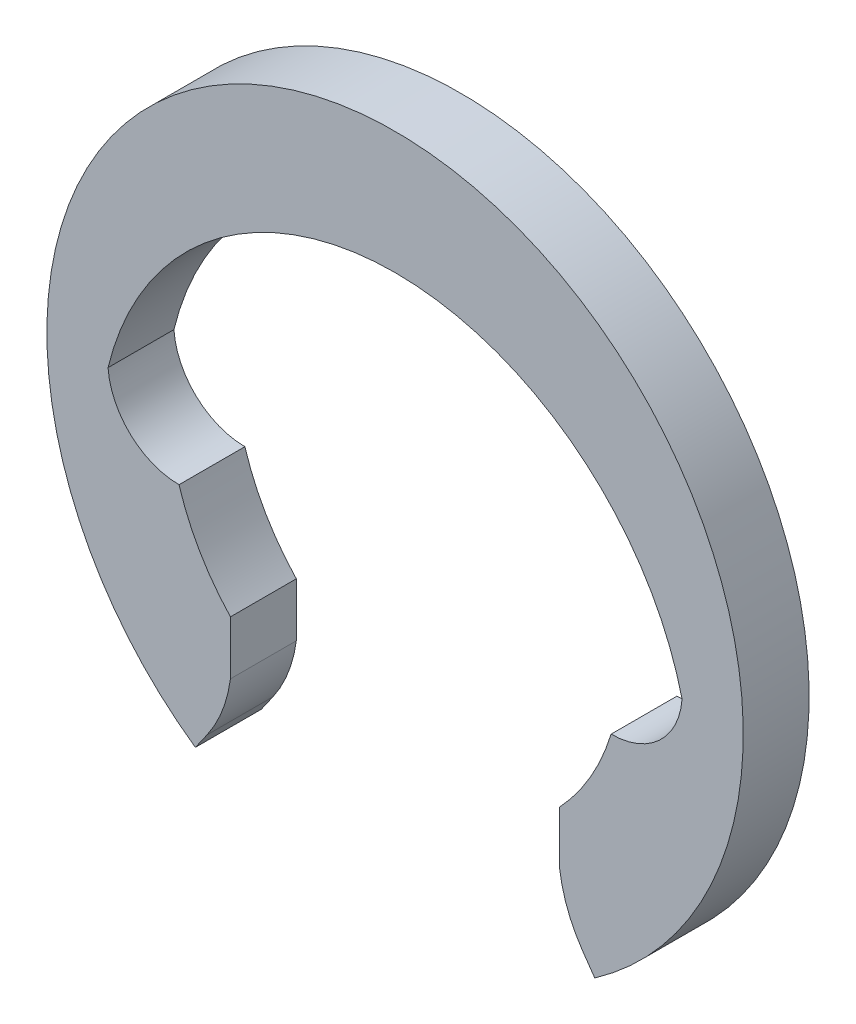
ISO-10303-21;
HEADER;
FILE_DESCRIPTION(('STEP AP214'),'2;1');
FILE_NAME('part.step','',(''),(''),'','','');
FILE_SCHEMA(('AUTOMOTIVE_DESIGN { 1 0 10303 214 1 1 1 1 }'));
ENDSEC;
DATA;
#1=APPLICATION_CONTEXT('core data for automotive mechanical design processes');
#2=APPLICATION_PROTOCOL_DEFINITION('international standard','automotive_design',2000,#1);
#3=PRODUCT_CONTEXT('',#1,'mechanical');
#4=PRODUCT('Part','Part','',(#3));
#5=PRODUCT_RELATED_PRODUCT_CATEGORY('part','',(#4));
#6=PRODUCT_DEFINITION_FORMATION('','',#4);
#7=PRODUCT_DEFINITION_CONTEXT('part definition',#1,'design');
#8=PRODUCT_DEFINITION('design','',#6,#7);
#9=PRODUCT_DEFINITION_SHAPE('','',#8);
#10=(LENGTH_UNIT() NAMED_UNIT(*) SI_UNIT(.MILLI.,.METRE.));
#11=(NAMED_UNIT(*) PLANE_ANGLE_UNIT() SI_UNIT($,.RADIAN.));
#12=(NAMED_UNIT(*) SI_UNIT($,.STERADIAN.) SOLID_ANGLE_UNIT());
#13=UNCERTAINTY_MEASURE_WITH_UNIT(LENGTH_MEASURE(1.E-05),#10,'distance_accuracy_value','');
#14=(GEOMETRIC_REPRESENTATION_CONTEXT(3) GLOBAL_UNCERTAINTY_ASSIGNED_CONTEXT((#13)) GLOBAL_UNIT_ASSIGNED_CONTEXT((#10,
#11,#12)) REPRESENTATION_CONTEXT('',''));
#15=CARTESIAN_POINT('',(0.,0.,0.));
#16=DIRECTION('',(0.,0.,1.));
#17=DIRECTION('',(1.,0.,0.));
#18=AXIS2_PLACEMENT_3D('',#15,#16,#17);
#19=CARTESIAN_POINT('',(-2.2956480566498,0.0564620388830179,0.699999999999999));
#20=DIRECTION('',(0.,0.,-1.));
#21=DIRECTION('',(-1.,0.,0.));
#22=AXIS2_PLACEMENT_3D('',#19,#20,#21);
#23=CYLINDRICAL_SURFACE('',#22,0.756462038883017);
#24=CARTESIAN_POINT('',(-2.2956480566498,0.0564620388830179,0.));
#25=DIRECTION('',(0.,0.,-1.));
#26=DIRECTION('',(1.,0.,0.));
#27=AXIS2_PLACEMENT_3D('',#24,#25,#26);
#28=CIRCLE('',#27,0.756462038883017);
#29=CARTESIAN_POINT('',(-2.2956480566498,-0.699999999999999,0.));
#30=VERTEX_POINT('',#29);
#31=CARTESIAN_POINT('',(-3.05,0.,0.));
#32=VERTEX_POINT('',#31);
#33=EDGE_CURVE('E162',#30,#32,#28,.T.);
#34=ORIENTED_EDGE('',*,*,#33,.T.);
#35=DIRECTION('',(0.,0.,-1.));
#36=VECTOR('',#35,1.);
#37=CARTESIAN_POINT('',(-3.05,0.,0.699999999999999));
#38=LINE('',#37,#36);
#39=CARTESIAN_POINT('',(-3.05,0.,0.699999999999999));
#40=VERTEX_POINT('',#39);
#41=EDGE_CURVE('E13',#40,#32,#38,.T.);
#42=ORIENTED_EDGE('',*,*,#41,.F.);
#43=CARTESIAN_POINT('',(-2.2956480566498,0.0564620388830179,0.699999999999999));
#44=DIRECTION('',(0.,0.,-1.));
#45=DIRECTION('',(1.,0.,0.));
#46=AXIS2_PLACEMENT_3D('',#43,#44,#45);
#47=CIRCLE('',#46,0.756462038883017);
#48=CARTESIAN_POINT('',(-2.2956480566498,-0.699999999999999,0.699999999999999));
#49=VERTEX_POINT('',#48);
#50=EDGE_CURVE('E185',#49,#40,#47,.T.);
#51=ORIENTED_EDGE('',*,*,#50,.F.);
#52=DIRECTION('',(0.,0.,-1.));
#53=VECTOR('',#52,1.);
#54=CARTESIAN_POINT('',(-2.2956480566498,-0.699999999999999,0.699999999999999));
#55=LINE('',#54,#53);
#56=EDGE_CURVE('E158',#49,#30,#55,.T.);
#57=ORIENTED_EDGE('',*,*,#56,.T.);
#58=EDGE_LOOP('',(#34,#42,#51,#57));
#59=FACE_BOUND('',#58,.T.);
#60=ADVANCED_FACE('F42',(#59),#23,.F.);
#61=CARTESIAN_POINT('',(0.,-0.738020833333334,0.699999999999999));
#62=DIRECTION('',(0.,0.,-1.));
#63=DIRECTION('',(-1.,0.,0.));
#64=AXIS2_PLACEMENT_3D('',#61,#62,#63);
#65=CYLINDRICAL_SURFACE('',#64,3.13802083333333);
#66=CARTESIAN_POINT('',(0.,-0.738020833333334,0.));
#67=DIRECTION('',(0.,0.,-1.));
#68=DIRECTION('',(1.,0.,0.));
#69=AXIS2_PLACEMENT_3D('',#66,#67,#68);
#70=CIRCLE('',#69,3.13802083333333);
#71=CARTESIAN_POINT('',(3.05,0.,0.));
#72=VERTEX_POINT('',#71);
#73=EDGE_CURVE('E165',#32,#72,#70,.T.);
#74=ORIENTED_EDGE('',*,*,#73,.T.);
#75=DIRECTION('',(0.,0.,-1.));
#76=VECTOR('',#75,1.);
#77=CARTESIAN_POINT('',(3.05,0.,0.699999999999999));
#78=LINE('',#77,#76);
#79=CARTESIAN_POINT('',(3.05,0.,0.699999999999999));
#80=VERTEX_POINT('',#79);
#81=EDGE_CURVE('E50',#80,#72,#78,.T.);
#82=ORIENTED_EDGE('',*,*,#81,.F.);
#83=CARTESIAN_POINT('',(0.,-0.738020833333334,0.699999999999999));
#84=DIRECTION('',(0.,0.,-1.));
#85=DIRECTION('',(1.,0.,0.));
#86=AXIS2_PLACEMENT_3D('',#83,#84,#85);
#87=CIRCLE('',#86,3.13802083333333);
#88=EDGE_CURVE('E112',#40,#80,#87,.T.);
#89=ORIENTED_EDGE('',*,*,#88,.F.);
#90=ORIENTED_EDGE('',*,*,#41,.T.);
#91=EDGE_LOOP('',(#74,#82,#89,#90));
#92=FACE_BOUND('',#91,.T.);
#93=ADVANCED_FACE('F262',(#92),#65,.F.);
#94=CARTESIAN_POINT('',(2.2956480566498,0.0564620388830184,0.699999999999999));
#95=DIRECTION('',(0.,0.,-1.));
#96=DIRECTION('',(-1.,0.,0.));
#97=AXIS2_PLACEMENT_3D('',#94,#95,#96);
#98=CYLINDRICAL_SURFACE('',#97,0.756462038883017);
#99=CARTESIAN_POINT('',(2.2956480566498,0.0564620388830184,0.));
#100=DIRECTION('',(0.,0.,-1.));
#101=DIRECTION('',(-1.,0.,0.));
#102=AXIS2_PLACEMENT_3D('',#99,#100,#101);
#103=CIRCLE('',#102,0.756462038883017);
#104=CARTESIAN_POINT('',(2.2956480566498,-0.699999999999999,0.));
#105=VERTEX_POINT('',#104);
#106=EDGE_CURVE('E167',#72,#105,#103,.T.);
#107=ORIENTED_EDGE('',*,*,#106,.T.);
#108=DIRECTION('',(0.,0.,-1.));
#109=VECTOR('',#108,1.);
#110=CARTESIAN_POINT('',(2.2956480566498,-0.699999999999999,0.699999999999999));
#111=LINE('',#110,#109);
#112=CARTESIAN_POINT('',(2.2956480566498,-0.699999999999999,0.699999999999999));
#113=VERTEX_POINT('',#112);
#114=EDGE_CURVE('E204',#113,#105,#111,.T.);
#115=ORIENTED_EDGE('',*,*,#114,.F.);
#116=CARTESIAN_POINT('',(2.2956480566498,0.0564620388830184,0.699999999999999));
#117=DIRECTION('',(0.,0.,-1.));
#118=DIRECTION('',(-1.,0.,0.));
#119=AXIS2_PLACEMENT_3D('',#116,#117,#118);
#120=CIRCLE('',#119,0.756462038883017);
#121=EDGE_CURVE('E212',#80,#113,#120,.T.);
#122=ORIENTED_EDGE('',*,*,#121,.F.);
#123=ORIENTED_EDGE('',*,*,#81,.T.);
#124=EDGE_LOOP('',(#107,#115,#122,#123));
#125=FACE_BOUND('',#124,.T.);
#126=ADVANCED_FACE('F210',(#125),#98,.F.);
#127=CARTESIAN_POINT('',(0.,0.,0.699999999999999));
#128=DIRECTION('',(0.,0.,-1.));
#129=DIRECTION('',(-1.,0.,0.));
#130=AXIS2_PLACEMENT_3D('',#127,#128,#129);
#131=CYLINDRICAL_SURFACE('',#130,2.4);
#132=CARTESIAN_POINT('',(0.,0.,0.));
#133=DIRECTION('',(0.,0.,-1.));
#134=DIRECTION('',(-1.,0.,0.));
#135=AXIS2_PLACEMENT_3D('',#132,#133,#134);
#136=CIRCLE('',#135,2.4);
#137=CARTESIAN_POINT('',(1.7494081308707,-1.64303718510675,0.));
#138=VERTEX_POINT('',#137);
#139=EDGE_CURVE('E169',#105,#138,#136,.T.);
#140=ORIENTED_EDGE('',*,*,#139,.T.);
#141=DIRECTION('',(0.,0.,-1.));
#142=VECTOR('',#141,1.);
#143=CARTESIAN_POINT('',(1.7494081308707,-1.64303718510675,0.699999999999999));
#144=LINE('',#143,#142);
#145=CARTESIAN_POINT('',(1.7494081308707,-1.64303718510675,0.699999999999999));
#146=VERTEX_POINT('',#145);
#147=EDGE_CURVE('E201',#146,#138,#144,.T.);
#148=ORIENTED_EDGE('',*,*,#147,.F.);
#149=CARTESIAN_POINT('',(0.,0.,0.699999999999999));
#150=DIRECTION('',(0.,0.,-1.));
#151=DIRECTION('',(-1.,0.,0.));
#152=AXIS2_PLACEMENT_3D('',#149,#150,#151);
#153=CIRCLE('',#152,2.4);
#154=EDGE_CURVE('E229',#113,#146,#153,.T.);
#155=ORIENTED_EDGE('',*,*,#154,.F.);
#156=ORIENTED_EDGE('',*,*,#114,.T.);
#157=EDGE_LOOP('',(#140,#148,#155,#156));
#158=FACE_BOUND('',#157,.T.);
#159=ADVANCED_FACE('F220',(#158),#131,.F.);
#160=CARTESIAN_POINT('',(1.7494081308707,-2.2132882184232,0.699999999999999));
#161=DIRECTION('',(1.,0.,0.));
#162=DIRECTION('',(0.,0.,-1.));
#163=AXIS2_PLACEMENT_3D('',#160,#161,#162);
#164=PLANE('',#163);
#165=DIRECTION('',(0.,-1.,0.));
#166=VECTOR('',#165,1.);
#167=CARTESIAN_POINT('',(1.7494081308707,-2.2132882184232,0.));
#168=LINE('',#167,#166);
#169=CARTESIAN_POINT('',(1.7494081308707,-2.2132882184232,0.));
#170=VERTEX_POINT('',#169);
#171=EDGE_CURVE('E172',#138,#170,#168,.T.);
#172=ORIENTED_EDGE('',*,*,#171,.T.);
#173=DIRECTION('',(0.,0.,-1.));
#174=VECTOR('',#173,1.);
#175=CARTESIAN_POINT('',(1.7494081308707,-2.2132882184232,0.699999999999999));
#176=LINE('',#175,#174);
#177=CARTESIAN_POINT('',(1.7494081308707,-2.2132882184232,0.699999999999999));
#178=VERTEX_POINT('',#177);
#179=EDGE_CURVE('E198',#178,#170,#176,.T.);
#180=ORIENTED_EDGE('',*,*,#179,.F.);
#181=DIRECTION('',(0.,-1.,0.));
#182=VECTOR('',#181,1.);
#183=CARTESIAN_POINT('',(1.7494081308707,-1.92816270176497,0.699999999999999));
#184=LINE('',#183,#182);
#185=EDGE_CURVE('E226',#146,#178,#184,.T.);
#186=ORIENTED_EDGE('',*,*,#185,.F.);
#187=ORIENTED_EDGE('',*,*,#147,.T.);
#188=EDGE_LOOP('',(#172,#180,#186,#187));
#189=FACE_BOUND('',#188,.T.);
#190=ADVANCED_FACE('F224',(#189),#164,.F.);
#191=CARTESIAN_POINT('',(3.17877685531491,-2.02656130114102,0.699999999999999));
#192=DIRECTION('',(0.,0.,-1.));
#193=DIRECTION('',(-1.,0.,0.));
#194=AXIS2_PLACEMENT_3D('',#191,#192,#193);
#195=CYLINDRICAL_SURFACE('',#194,1.44151375021433);
#196=CARTESIAN_POINT('',(3.17877685531491,-2.02656130114102,0.));
#197=DIRECTION('',(0.,0.,1.));
#198=DIRECTION('',(1.,0.,0.));
#199=AXIS2_PLACEMENT_3D('',#196,#197,#198);
#200=CIRCLE('',#199,1.44151375021433);
#201=CARTESIAN_POINT('',(1.99795791995615,-2.85337962093998,0.));
#202=VERTEX_POINT('',#201);
#203=EDGE_CURVE('E174',#170,#202,#200,.T.);
#204=ORIENTED_EDGE('',*,*,#203,.T.);
#205=DIRECTION('',(0.,0.,-1.));
#206=VECTOR('',#205,1.);
#207=CARTESIAN_POINT('',(1.99795791995615,-2.85337962093998,0.699999999999999));
#208=LINE('',#207,#206);
#209=CARTESIAN_POINT('',(1.99795791995615,-2.85337962093998,0.699999999999999));
#210=VERTEX_POINT('',#209);
#211=EDGE_CURVE('E195',#210,#202,#208,.T.);
#212=ORIENTED_EDGE('',*,*,#211,.F.);
#213=CARTESIAN_POINT('',(3.17877685531491,-2.02656130114102,0.699999999999999));
#214=DIRECTION('',(0.,0.,1.));
#215=DIRECTION('',(1.,0.,0.));
#216=AXIS2_PLACEMENT_3D('',#213,#214,#215);
#217=CIRCLE('',#216,1.44151375021433);
#218=EDGE_CURVE('E228',#178,#210,#217,.T.);
#219=ORIENTED_EDGE('',*,*,#218,.F.);
#220=ORIENTED_EDGE('',*,*,#179,.T.);
#221=EDGE_LOOP('',(#204,#212,#219,#220));
#222=FACE_BOUND('',#221,.T.);
#223=ADVANCED_FACE('F275',(#222),#195,.T.);
#224=CARTESIAN_POINT('',(1.99795791995615,-2.85337962093998,0.699999999999999));
#225=DIRECTION('',(0.819152044288992,0.573576436351046,0.));
#226=DIRECTION('',(-0.573576436351046,0.819152044288992,0.));
#227=AXIS2_PLACEMENT_3D('',#224,#225,#226);
#228=PLANE('',#227);
#229=DIRECTION('',(0.573576436351046,-0.819152044288992,0.));
#230=VECTOR('',#229,1.);
#231=CARTESIAN_POINT('',(1.99795791995615,-2.85337962093998,0.));
#232=LINE('',#231,#230);
#233=CARTESIAN_POINT('',(2.12223281449888,-3.03086256386927,0.));
#234=VERTEX_POINT('',#233);
#235=EDGE_CURVE('E176',#202,#234,#232,.T.);
#236=ORIENTED_EDGE('',*,*,#235,.T.);
#237=DIRECTION('',(0.,0.,-1.));
#238=VECTOR('',#237,1.);
#239=CARTESIAN_POINT('',(2.12223281449888,-3.03086256386927,0.699999999999999));
#240=LINE('',#239,#238);
#241=CARTESIAN_POINT('',(2.12223281449888,-3.03086256386927,0.699999999999999));
#242=VERTEX_POINT('',#241);
#243=EDGE_CURVE('E192',#242,#234,#240,.T.);
#244=ORIENTED_EDGE('',*,*,#243,.F.);
#245=DIRECTION('',(0.573576436351046,-0.819152044288992,0.));
#246=VECTOR('',#245,1.);
#247=CARTESIAN_POINT('',(1.99795791995615,-2.85337962093998,0.699999999999999));
#248=LINE('',#247,#246);
#249=EDGE_CURVE('E231',#210,#242,#248,.T.);
#250=ORIENTED_EDGE('',*,*,#249,.F.);
#251=ORIENTED_EDGE('',*,*,#211,.T.);
#252=EDGE_LOOP('',(#236,#244,#250,#251));
#253=FACE_BOUND('',#252,.T.);
#254=ADVANCED_FACE('F278',(#253),#228,.F.);
#255=CARTESIAN_POINT('',(0.,0.,0.699999999999999));
#256=DIRECTION('',(0.,0.,-1.));
#257=DIRECTION('',(-1.,0.,0.));
#258=AXIS2_PLACEMENT_3D('',#255,#256,#257);
#259=CYLINDRICAL_SURFACE('',#258,3.7);
#260=CARTESIAN_POINT('',(0.,0.,0.));
#261=DIRECTION('',(0.,0.,1.));
#262=DIRECTION('',(1.,0.,0.));
#263=AXIS2_PLACEMENT_3D('',#260,#261,#262);
#264=CIRCLE('',#263,3.7);
#265=CARTESIAN_POINT('',(-2.12223281449887,-3.03086256386927,0.));
#266=VERTEX_POINT('',#265);
#267=EDGE_CURVE('E178',#234,#266,#264,.T.);
#268=ORIENTED_EDGE('',*,*,#267,.T.);
#269=DIRECTION('',(0.,0.,-1.));
#270=VECTOR('',#269,1.);
#271=CARTESIAN_POINT('',(-2.12223281449887,-3.03086256386927,0.699999999999999));
#272=LINE('',#271,#270);
#273=CARTESIAN_POINT('',(-2.12223281449887,-3.03086256386927,0.699999999999999));
#274=VERTEX_POINT('',#273);
#275=EDGE_CURVE('E189',#274,#266,#272,.T.);
#276=ORIENTED_EDGE('',*,*,#275,.F.);
#277=CARTESIAN_POINT('',(0.,0.,0.699999999999999));
#278=DIRECTION('',(0.,0.,1.));
#279=DIRECTION('',(1.,0.,0.));
#280=AXIS2_PLACEMENT_3D('',#277,#278,#279);
#281=CIRCLE('',#280,3.7);
#282=EDGE_CURVE('E237',#242,#274,#281,.T.);
#283=ORIENTED_EDGE('',*,*,#282,.F.);
#284=ORIENTED_EDGE('',*,*,#243,.T.);
#285=EDGE_LOOP('',(#268,#276,#283,#284));
#286=FACE_BOUND('',#285,.T.);
#287=ADVANCED_FACE('F243',(#286),#259,.T.);
#288=CARTESIAN_POINT('',(-1.99795791995615,-2.85337962093998,0.699999999999999));
#289=DIRECTION('',(-0.819152044288991,0.573576436351048,0.));
#290=DIRECTION('',(-0.573576436351048,-0.819152044288991,0.));
#291=AXIS2_PLACEMENT_3D('',#288,#289,#290);
#292=PLANE('',#291);
#293=DIRECTION('',(0.573576436351048,0.819152044288991,0.));
#294=VECTOR('',#293,1.);
#295=CARTESIAN_POINT('',(-1.99795791995615,-2.85337962093998,0.));
#296=LINE('',#295,#294);
#297=CARTESIAN_POINT('',(-1.99795791995615,-2.85337962093998,0.));
#298=VERTEX_POINT('',#297);
#299=EDGE_CURVE('E180',#266,#298,#296,.T.);
#300=ORIENTED_EDGE('',*,*,#299,.T.);
#301=DIRECTION('',(0.,0.,-1.));
#302=VECTOR('',#301,1.);
#303=CARTESIAN_POINT('',(-1.99795791995615,-2.85337962093998,0.699999999999999));
#304=LINE('',#303,#302);
#305=CARTESIAN_POINT('',(-1.99795791995615,-2.85337962093998,0.699999999999999));
#306=VERTEX_POINT('',#305);
#307=EDGE_CURVE('E153',#306,#298,#304,.T.);
#308=ORIENTED_EDGE('',*,*,#307,.F.);
#309=DIRECTION('',(0.573576436351048,0.819152044288991,0.));
#310=VECTOR('',#309,1.);
#311=CARTESIAN_POINT('',(-1.99795791995615,-2.85337962093998,0.699999999999999));
#312=LINE('',#311,#310);
#313=EDGE_CURVE('E143',#274,#306,#312,.T.);
#314=ORIENTED_EDGE('',*,*,#313,.F.);
#315=ORIENTED_EDGE('',*,*,#275,.T.);
#316=EDGE_LOOP('',(#300,#308,#314,#315));
#317=FACE_BOUND('',#316,.T.);
#318=ADVANCED_FACE('F247',(#317),#292,.F.);
#319=CARTESIAN_POINT('',(-3.17877685531491,-2.02656130114102,0.699999999999999));
#320=DIRECTION('',(0.,0.,-1.));
#321=DIRECTION('',(-1.,0.,0.));
#322=AXIS2_PLACEMENT_3D('',#319,#320,#321);
#323=CYLINDRICAL_SURFACE('',#322,1.44151375021433);
#324=CARTESIAN_POINT('',(-3.17877685531491,-2.02656130114102,0.));
#325=DIRECTION('',(0.,0.,1.));
#326=DIRECTION('',(-1.,0.,0.));
#327=AXIS2_PLACEMENT_3D('',#324,#325,#326);
#328=CIRCLE('',#327,1.44151375021433);
#329=CARTESIAN_POINT('',(-1.74940813087069,-2.2132882184232,0.));
#330=VERTEX_POINT('',#329);
#331=EDGE_CURVE('E152',#298,#330,#328,.T.);
#332=ORIENTED_EDGE('',*,*,#331,.T.);
#333=DIRECTION('',(0.,0.,-1.));
#334=VECTOR('',#333,1.);
#335=CARTESIAN_POINT('',(-1.74940813087069,-2.2132882184232,0.699999999999999));
#336=LINE('',#335,#334);
#337=CARTESIAN_POINT('',(-1.74940813087069,-2.2132882184232,0.699999999999999));
#338=VERTEX_POINT('',#337);
#339=EDGE_CURVE('E149',#338,#330,#336,.T.);
#340=ORIENTED_EDGE('',*,*,#339,.F.);
#341=CARTESIAN_POINT('',(-3.17877685531491,-2.02656130114102,0.699999999999999));
#342=DIRECTION('',(0.,0.,1.));
#343=DIRECTION('',(-1.,0.,0.));
#344=AXIS2_PLACEMENT_3D('',#341,#342,#343);
#345=CIRCLE('',#344,1.44151375021433);
#346=EDGE_CURVE('E137',#306,#338,#345,.T.);
#347=ORIENTED_EDGE('',*,*,#346,.F.);
#348=ORIENTED_EDGE('',*,*,#307,.T.);
#349=EDGE_LOOP('',(#332,#340,#347,#348));
#350=FACE_BOUND('',#349,.T.);
#351=ADVANCED_FACE('F150',(#350),#323,.T.);
#352=CARTESIAN_POINT('',(-1.74940813087069,-1.92816270176497,0.699999999999999));
#353=DIRECTION('',(-1.,0.,0.));
#354=DIRECTION('',(0.,0.,1.));
#355=AXIS2_PLACEMENT_3D('',#352,#353,#354);
#356=PLANE('',#355);
#357=DIRECTION('',(0.,1.,0.));
#358=VECTOR('',#357,1.);
#359=CARTESIAN_POINT('',(-1.74940813087069,-1.92816270176497,0.));
#360=LINE('',#359,#358);
#361=CARTESIAN_POINT('',(-1.74940813087069,-1.64303718510675,0.));
#362=VERTEX_POINT('',#361);
#363=EDGE_CURVE('E98',#330,#362,#360,.T.);
#364=ORIENTED_EDGE('',*,*,#363,.T.);
#365=DIRECTION('',(0.,0.,-1.));
#366=VECTOR('',#365,1.);
#367=CARTESIAN_POINT('',(-1.74940813087069,-1.64303718510675,0.699999999999999));
#368=LINE('',#367,#366);
#369=CARTESIAN_POINT('',(-1.74940813087069,-1.64303718510675,0.699999999999999));
#370=VERTEX_POINT('',#369);
#371=EDGE_CURVE('E154',#370,#362,#368,.T.);
#372=ORIENTED_EDGE('',*,*,#371,.F.);
#373=DIRECTION('',(0.,1.,0.));
#374=VECTOR('',#373,1.);
#375=CARTESIAN_POINT('',(-1.74940813087069,-2.2132882184232,0.699999999999999));
#376=LINE('',#375,#374);
#377=EDGE_CURVE('E141',#338,#370,#376,.T.);
#378=ORIENTED_EDGE('',*,*,#377,.F.);
#379=ORIENTED_EDGE('',*,*,#339,.T.);
#380=EDGE_LOOP('',(#364,#372,#378,#379));
#381=FACE_BOUND('',#380,.T.);
#382=ADVANCED_FACE('F156',(#381),#356,.F.);
#383=CARTESIAN_POINT('',(0.,0.,0.699999999999999));
#384=DIRECTION('',(0.,0.,-1.));
#385=DIRECTION('',(-1.,0.,0.));
#386=AXIS2_PLACEMENT_3D('',#383,#384,#385);
#387=CYLINDRICAL_SURFACE('',#386,2.4);
#388=CARTESIAN_POINT('',(0.,0.,0.));
#389=DIRECTION('',(0.,0.,-1.));
#390=DIRECTION('',(1.,0.,0.));
#391=AXIS2_PLACEMENT_3D('',#388,#389,#390);
#392=CIRCLE('',#391,2.4);
#393=EDGE_CURVE('E104',#362,#30,#392,.T.);
#394=ORIENTED_EDGE('',*,*,#393,.T.);
#395=ORIENTED_EDGE('',*,*,#56,.F.);
#396=CARTESIAN_POINT('',(0.,0.,0.699999999999999));
#397=DIRECTION('',(0.,0.,-1.));
#398=DIRECTION('',(1.,0.,0.));
#399=AXIS2_PLACEMENT_3D('',#396,#397,#398);
#400=CIRCLE('',#399,2.4);
#401=EDGE_CURVE('E58',#370,#49,#400,.T.);
#402=ORIENTED_EDGE('',*,*,#401,.F.);
#403=ORIENTED_EDGE('',*,*,#371,.T.);
#404=EDGE_LOOP('',(#394,#395,#402,#403));
#405=FACE_BOUND('',#404,.T.);
#406=ADVANCED_FACE('F251',(#405),#387,.F.);
#407=CARTESIAN_POINT('',(-2.2956480566498,0.0564620388830179,0.699999999999999));
#408=DIRECTION('',(0.,0.,1.));
#409=DIRECTION('',(1.,0.,0.));
#410=AXIS2_PLACEMENT_3D('',#407,#408,#409);
#411=PLANE('',#410);
#412=ORIENTED_EDGE('',*,*,#50,.T.);
#413=ORIENTED_EDGE('',*,*,#88,.T.);
#414=ORIENTED_EDGE('',*,*,#121,.T.);
#415=ORIENTED_EDGE('',*,*,#154,.T.);
#416=ORIENTED_EDGE('',*,*,#185,.T.);
#417=ORIENTED_EDGE('',*,*,#218,.T.);
#418=ORIENTED_EDGE('',*,*,#249,.T.);
#419=ORIENTED_EDGE('',*,*,#282,.T.);
#420=ORIENTED_EDGE('',*,*,#313,.T.);
#421=ORIENTED_EDGE('',*,*,#346,.T.);
#422=ORIENTED_EDGE('',*,*,#377,.T.);
#423=ORIENTED_EDGE('',*,*,#401,.T.);
#424=EDGE_LOOP('',(#412,#413,#414,#415,#416,#417,#418,#419,#420,#421,#422,#423));
#425=FACE_BOUND('',#424,.T.);
#426=ADVANCED_FACE('F139',(#425),#411,.T.);
#427=CARTESIAN_POINT('',(-2.2956480566498,0.0564620388830179,0.));
#428=DIRECTION('',(0.,0.,1.));
#429=DIRECTION('',(1.,0.,0.));
#430=AXIS2_PLACEMENT_3D('',#427,#428,#429);
#431=PLANE('',#430);
#432=ORIENTED_EDGE('',*,*,#33,.F.);
#433=ORIENTED_EDGE('',*,*,#393,.F.);
#434=ORIENTED_EDGE('',*,*,#363,.F.);
#435=ORIENTED_EDGE('',*,*,#331,.F.);
#436=ORIENTED_EDGE('',*,*,#299,.F.);
#437=ORIENTED_EDGE('',*,*,#267,.F.);
#438=ORIENTED_EDGE('',*,*,#235,.F.);
#439=ORIENTED_EDGE('',*,*,#203,.F.);
#440=ORIENTED_EDGE('',*,*,#171,.F.);
#441=ORIENTED_EDGE('',*,*,#139,.F.);
#442=ORIENTED_EDGE('',*,*,#106,.F.);
#443=ORIENTED_EDGE('',*,*,#73,.F.);
#444=EDGE_LOOP('',(#432,#433,#434,#435,#436,#437,#438,#439,#440,#441,#442,#443));
#445=FACE_BOUND('',#444,.T.);
#446=ADVANCED_FACE('F216',(#445),#431,.F.);
#447=CLOSED_SHELL('',(#60,#93,#126,#159,#190,#223,#254,#287,#318,#351,#382,#406,#426,#446));
#448=MANIFOLD_SOLID_BREP('B2',#447);
#449=ADVANCED_BREP_SHAPE_REPRESENTATION('',(#18,#448),#14);
#450=SHAPE_DEFINITION_REPRESENTATION(#9,#449);
ENDSEC;
END-ISO-10303-21;
